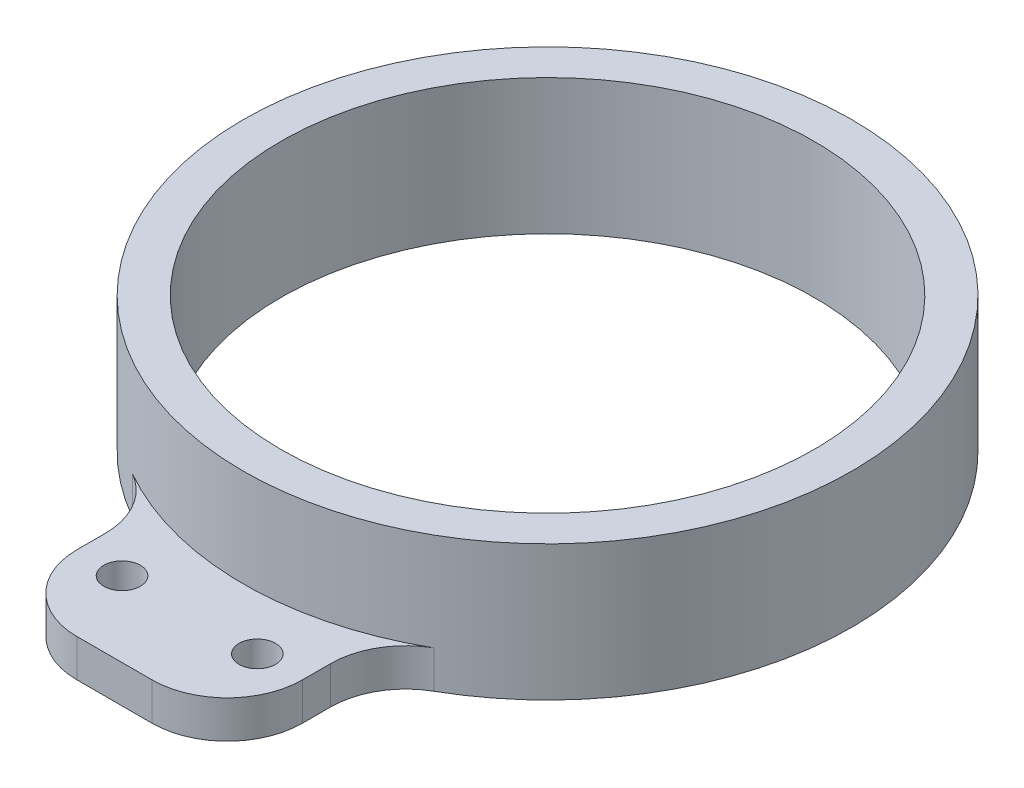
ISO-10303-21;
HEADER;
FILE_DESCRIPTION(('STEP AP214'),'2;1');
FILE_NAME('part.step','',(''),(''),'','','');
FILE_SCHEMA(('AUTOMOTIVE_DESIGN { 1 0 10303 214 1 1 1 1 }'));
ENDSEC;
DATA;
#1=APPLICATION_CONTEXT('core data for automotive mechanical design processes');
#2=APPLICATION_PROTOCOL_DEFINITION('international standard','automotive_design',2000,#1);
#3=PRODUCT_CONTEXT('',#1,'mechanical');
#4=PRODUCT('Part','Part','',(#3));
#5=PRODUCT_RELATED_PRODUCT_CATEGORY('part','',(#4));
#6=PRODUCT_DEFINITION_FORMATION('','',#4);
#7=PRODUCT_DEFINITION_CONTEXT('part definition',#1,'design');
#8=PRODUCT_DEFINITION('design','',#6,#7);
#9=PRODUCT_DEFINITION_SHAPE('','',#8);
#10=(LENGTH_UNIT() NAMED_UNIT(*) SI_UNIT(.MILLI.,.METRE.));
#11=(NAMED_UNIT(*) PLANE_ANGLE_UNIT() SI_UNIT($,.RADIAN.));
#12=(NAMED_UNIT(*) SI_UNIT($,.STERADIAN.) SOLID_ANGLE_UNIT());
#13=UNCERTAINTY_MEASURE_WITH_UNIT(LENGTH_MEASURE(1.E-05),#10,'distance_accuracy_value','');
#14=(GEOMETRIC_REPRESENTATION_CONTEXT(3) GLOBAL_UNCERTAINTY_ASSIGNED_CONTEXT((#13)) GLOBAL_UNIT_ASSIGNED_CONTEXT((#10,
#11,#12)) REPRESENTATION_CONTEXT('',''));
#15=CARTESIAN_POINT('',(0.,0.,0.));
#16=DIRECTION('',(0.,0.,1.));
#17=DIRECTION('',(1.,0.,0.));
#18=AXIS2_PLACEMENT_3D('',#15,#16,#17);
#19=CARTESIAN_POINT('',(0.,9.,0.));
#20=DIRECTION('',(0.,1.,0.));
#21=DIRECTION('',(0.,0.,1.));
#22=AXIS2_PLACEMENT_3D('',#19,#20,#21);
#23=PLANE('',#22);
#24=CARTESIAN_POINT('',(0.,9.,0.));
#25=DIRECTION('',(0.,1.,0.));
#26=DIRECTION('',(0.,0.,1.));
#27=AXIS2_PLACEMENT_3D('',#24,#25,#26);
#28=CIRCLE('',#27,40.5);
#29=CARTESIAN_POINT('',(0.,9.,40.5));
#30=VERTEX_POINT('',#29);
#31=EDGE_CURVE('E127',#30,#30,#28,.T.);
#32=ORIENTED_EDGE('',*,*,#31,.T.);
#33=EDGE_LOOP('',(#32));
#34=FACE_BOUND('',#33,.T.);
#35=CARTESIAN_POINT('',(0.,9.,0.));
#36=DIRECTION('',(0.,1.,0.));
#37=DIRECTION('',(0.,0.,1.));
#38=AXIS2_PLACEMENT_3D('',#35,#36,#37);
#39=CIRCLE('',#38,35.5);
#40=CARTESIAN_POINT('',(0.,9.,35.5));
#41=VERTEX_POINT('',#40);
#42=EDGE_CURVE('E128',#41,#41,#39,.T.);
#43=ORIENTED_EDGE('',*,*,#42,.F.);
#44=EDGE_LOOP('',(#43));
#45=FACE_BOUND('',#44,.T.);
#46=ADVANCED_FACE('F33',(#34,#45),#23,.T.);
#47=CARTESIAN_POINT('',(0.,-9.,0.));
#48=DIRECTION('',(0.,1.,0.));
#49=DIRECTION('',(0.,0.,1.));
#50=AXIS2_PLACEMENT_3D('',#47,#48,#49);
#51=PLANE('',#50);
#52=DIRECTION('',(-1.,0.,0.));
#53=VECTOR('',#52,1.);
#54=CARTESIAN_POINT('',(-15.,-9.,57.6198086119534));
#55=LINE('',#54,#53);
#56=CARTESIAN_POINT('',(5.,-9.,57.6198086119534));
#57=VERTEX_POINT('',#56);
#58=CARTESIAN_POINT('',(-5.,-9.,57.6198086119534));
#59=VERTEX_POINT('',#58);
#60=EDGE_CURVE('E176',#57,#59,#55,.T.);
#61=ORIENTED_EDGE('',*,*,#60,.T.);
#62=CARTESIAN_POINT('',(-5.,-9.,47.6198086119534));
#63=DIRECTION('',(0.,1.,0.));
#64=DIRECTION('',(0.,0.,1.));
#65=AXIS2_PLACEMENT_3D('',#62,#63,#64);
#66=CIRCLE('',#65,10.);
#67=CARTESIAN_POINT('',(-15.,-9.,47.6198086119534));
#68=VERTEX_POINT('',#67);
#69=EDGE_CURVE('E152',#59,#68,#66,.F.);
#70=ORIENTED_EDGE('',*,*,#69,.T.);
#71=DIRECTION('',(0.,0.,-1.));
#72=VECTOR('',#71,1.);
#73=CARTESIAN_POINT('',(-15.,-9.,37.6198086119534));
#74=LINE('',#73,#72);
#75=CARTESIAN_POINT('',(-15.,-9.,43.8776708588776));
#76=VERTEX_POINT('',#75);
#77=EDGE_CURVE('E168',#68,#76,#74,.T.);
#78=ORIENTED_EDGE('',*,*,#77,.T.);
#79=CARTESIAN_POINT('',(-25.,-9.,43.8776708588776));
#80=DIRECTION('',(0.,1.,0.));
#81=DIRECTION('',(0.,0.,1.));
#82=AXIS2_PLACEMENT_3D('',#79,#80,#81);
#83=CIRCLE('',#82,10.);
#84=CARTESIAN_POINT('',(-20.049504950495,-9.,35.1890231640504));
#85=VERTEX_POINT('',#84);
#86=EDGE_CURVE('E41',#76,#85,#83,.T.);
#87=ORIENTED_EDGE('',*,*,#86,.T.);
#88=CARTESIAN_POINT('',(0.,-9.,0.));
#89=DIRECTION('',(0.,1.,0.));
#90=DIRECTION('',(0.,0.,1.));
#91=AXIS2_PLACEMENT_3D('',#88,#89,#90);
#92=CIRCLE('',#91,40.5);
#93=CARTESIAN_POINT('',(20.049504950495,-9.,35.1890231640504));
#94=VERTEX_POINT('',#93);
#95=EDGE_CURVE('E116',#94,#85,#92,.T.);
#96=ORIENTED_EDGE('',*,*,#95,.F.);
#97=CARTESIAN_POINT('',(25.,-9.,43.8776708588776));
#98=DIRECTION('',(0.,1.,0.));
#99=DIRECTION('',(0.,0.,1.));
#100=AXIS2_PLACEMENT_3D('',#97,#98,#99);
#101=CIRCLE('',#100,10.);
#102=CARTESIAN_POINT('',(15.,-9.,43.8776708588776));
#103=VERTEX_POINT('',#102);
#104=EDGE_CURVE('E99',#94,#103,#101,.T.);
#105=ORIENTED_EDGE('',*,*,#104,.T.);
#106=DIRECTION('',(0.,0.,1.));
#107=VECTOR('',#106,1.);
#108=CARTESIAN_POINT('',(15.,-9.,57.6198086119534));
#109=LINE('',#108,#107);
#110=CARTESIAN_POINT('',(15.,-9.,47.6198086119534));
#111=VERTEX_POINT('',#110);
#112=EDGE_CURVE('E174',#103,#111,#109,.T.);
#113=ORIENTED_EDGE('',*,*,#112,.T.);
#114=CARTESIAN_POINT('',(5.,-9.,47.6198086119534));
#115=DIRECTION('',(0.,1.,0.));
#116=DIRECTION('',(0.,0.,1.));
#117=AXIS2_PLACEMENT_3D('',#114,#115,#116);
#118=CIRCLE('',#117,10.);
#119=EDGE_CURVE('E150',#111,#57,#118,.F.);
#120=ORIENTED_EDGE('',*,*,#119,.T.);
#121=EDGE_LOOP('',(#61,#70,#78,#87,#96,#105,#113,#120));
#122=FACE_BOUND('',#121,.T.);
#123=CARTESIAN_POINT('',(0.,-9.,0.));
#124=DIRECTION('',(0.,1.,0.));
#125=DIRECTION('',(0.,0.,1.));
#126=AXIS2_PLACEMENT_3D('',#123,#124,#125);
#127=CIRCLE('',#126,35.5);
#128=CARTESIAN_POINT('',(0.,-9.,35.5));
#129=VERTEX_POINT('',#128);
#130=EDGE_CURVE('E133',#129,#129,#127,.T.);
#131=ORIENTED_EDGE('',*,*,#130,.T.);
#132=EDGE_LOOP('',(#131));
#133=FACE_BOUND('',#132,.T.);
#134=CARTESIAN_POINT('',(9.,-9.,47.6198086119534));
#135=DIRECTION('',(0.,-1.,0.));
#136=DIRECTION('',(0.,0.,1.));
#137=AXIS2_PLACEMENT_3D('',#134,#135,#136);
#138=CIRCLE('',#137,2.42927418863049);
#139=CARTESIAN_POINT('',(9.,-9.,50.0490828005839));
#140=VERTEX_POINT('',#139);
#141=EDGE_CURVE('E246',#140,#140,#138,.T.);
#142=ORIENTED_EDGE('',*,*,#141,.F.);
#143=EDGE_LOOP('',(#142));
#144=FACE_BOUND('',#143,.T.);
#145=CARTESIAN_POINT('',(-9.,-9.,47.6198086119534));
#146=DIRECTION('',(0.,-1.,0.));
#147=DIRECTION('',(0.,0.,-1.));
#148=AXIS2_PLACEMENT_3D('',#145,#146,#147);
#149=CIRCLE('',#148,2.42927418863049);
#150=CARTESIAN_POINT('',(-9.,-9.,45.1905344233229));
#151=VERTEX_POINT('',#150);
#152=EDGE_CURVE('E248',#151,#151,#149,.T.);
#153=ORIENTED_EDGE('',*,*,#152,.F.);
#154=EDGE_LOOP('',(#153));
#155=FACE_BOUND('',#154,.T.);
#156=ADVANCED_FACE('F124',(#122,#133,#144,#155),#51,.F.);
#157=CARTESIAN_POINT('',(0.,9.,0.));
#158=DIRECTION('',(0.,-1.,0.));
#159=DIRECTION('',(0.,0.,-1.));
#160=AXIS2_PLACEMENT_3D('',#157,#158,#159);
#161=CYLINDRICAL_SURFACE('',#160,40.5);
#162=CARTESIAN_POINT('',(0.,-4.,0.));
#163=DIRECTION('',(0.,1.,0.));
#164=DIRECTION('',(0.,0.,-1.));
#165=AXIS2_PLACEMENT_3D('',#162,#163,#164);
#166=CIRCLE('',#165,40.5);
#167=CARTESIAN_POINT('',(-20.049504950495,-4.,35.1890231640504));
#168=VERTEX_POINT('',#167);
#169=CARTESIAN_POINT('',(20.049504950495,-4.,35.1890231640504));
#170=VERTEX_POINT('',#169);
#171=EDGE_CURVE('E118',#168,#170,#166,.T.);
#172=ORIENTED_EDGE('',*,*,#171,.T.);
#173=DIRECTION('',(0.,-1.,0.));
#174=VECTOR('',#173,1.);
#175=CARTESIAN_POINT('',(20.0495049504951,9.,35.1890231640504));
#176=LINE('',#175,#174);
#177=EDGE_CURVE('E103',#170,#94,#176,.T.);
#178=ORIENTED_EDGE('',*,*,#177,.T.);
#179=ORIENTED_EDGE('',*,*,#95,.T.);
#180=DIRECTION('',(0.,-1.,0.));
#181=VECTOR('',#180,1.);
#182=CARTESIAN_POINT('',(-20.0495049504951,9.,35.1890231640504));
#183=LINE('',#182,#181);
#184=EDGE_CURVE('E121',#85,#168,#183,.F.);
#185=ORIENTED_EDGE('',*,*,#184,.T.);
#186=EDGE_LOOP('',(#172,#178,#179,#185));
#187=FACE_BOUND('',#186,.T.);
#188=ORIENTED_EDGE('',*,*,#31,.F.);
#189=EDGE_LOOP('',(#188));
#190=FACE_BOUND('',#189,.T.);
#191=ADVANCED_FACE('F113',(#187,#190),#161,.T.);
#192=CARTESIAN_POINT('',(0.,9.,0.));
#193=DIRECTION('',(0.,-1.,0.));
#194=DIRECTION('',(0.,0.,-1.));
#195=AXIS2_PLACEMENT_3D('',#192,#193,#194);
#196=CYLINDRICAL_SURFACE('',#195,35.5);
#197=ORIENTED_EDGE('',*,*,#42,.T.);
#198=EDGE_LOOP('',(#197));
#199=FACE_BOUND('',#198,.T.);
#200=ORIENTED_EDGE('',*,*,#130,.F.);
#201=EDGE_LOOP('',(#200));
#202=FACE_BOUND('',#201,.T.);
#203=ADVANCED_FACE('F183',(#199,#202),#196,.F.);
#204=CARTESIAN_POINT('',(-15.,-4.,37.6198086119534));
#205=DIRECTION('',(-1.,0.,0.));
#206=DIRECTION('',(0.,0.,1.));
#207=AXIS2_PLACEMENT_3D('',#204,#205,#206);
#208=PLANE('',#207);
#209=DIRECTION('',(0.,0.,-1.));
#210=VECTOR('',#209,1.);
#211=CARTESIAN_POINT('',(-15.,-4.,37.6198086119534));
#212=LINE('',#211,#210);
#213=CARTESIAN_POINT('',(-15.,-4.,47.6198086119534));
#214=VERTEX_POINT('',#213);
#215=CARTESIAN_POINT('',(-15.,-4.,43.8776708588776));
#216=VERTEX_POINT('',#215);
#217=EDGE_CURVE('E166',#214,#216,#212,.T.);
#218=ORIENTED_EDGE('',*,*,#217,.T.);
#219=DIRECTION('',(0.,-1.,0.));
#220=VECTOR('',#219,1.);
#221=CARTESIAN_POINT('',(-15.,-4.,43.8776708588776));
#222=LINE('',#221,#220);
#223=EDGE_CURVE('E143',#216,#76,#222,.T.);
#224=ORIENTED_EDGE('',*,*,#223,.T.);
#225=ORIENTED_EDGE('',*,*,#77,.F.);
#226=DIRECTION('',(0.,-1.,0.));
#227=VECTOR('',#226,1.);
#228=CARTESIAN_POINT('',(-15.,-4.,47.6198086119534));
#229=LINE('',#228,#227);
#230=EDGE_CURVE('E141',#68,#214,#229,.F.);
#231=ORIENTED_EDGE('',*,*,#230,.T.);
#232=EDGE_LOOP('',(#218,#224,#225,#231));
#233=FACE_BOUND('',#232,.T.);
#234=ADVANCED_FACE('F185',(#233),#208,.T.);
#235=CARTESIAN_POINT('',(-15.,-4.,57.6198086119534));
#236=DIRECTION('',(0.,0.,1.));
#237=DIRECTION('',(1.,0.,0.));
#238=AXIS2_PLACEMENT_3D('',#235,#236,#237);
#239=PLANE('',#238);
#240=DIRECTION('',(-1.,0.,0.));
#241=VECTOR('',#240,1.);
#242=CARTESIAN_POINT('',(-15.,-4.,57.6198086119534));
#243=LINE('',#242,#241);
#244=CARTESIAN_POINT('',(5.,-4.,57.6198086119534));
#245=VERTEX_POINT('',#244);
#246=CARTESIAN_POINT('',(-5.,-4.,57.6198086119534));
#247=VERTEX_POINT('',#246);
#248=EDGE_CURVE('E164',#245,#247,#243,.T.);
#249=ORIENTED_EDGE('',*,*,#248,.T.);
#250=DIRECTION('',(0.,-1.,0.));
#251=VECTOR('',#250,1.);
#252=CARTESIAN_POINT('',(-5.,-4.,57.6198086119534));
#253=LINE('',#252,#251);
#254=EDGE_CURVE('E147',#247,#59,#253,.T.);
#255=ORIENTED_EDGE('',*,*,#254,.T.);
#256=ORIENTED_EDGE('',*,*,#60,.F.);
#257=DIRECTION('',(0.,-1.,0.));
#258=VECTOR('',#257,1.);
#259=CARTESIAN_POINT('',(5.,-4.,57.6198086119534));
#260=LINE('',#259,#258);
#261=EDGE_CURVE('E55',#57,#245,#260,.F.);
#262=ORIENTED_EDGE('',*,*,#261,.T.);
#263=EDGE_LOOP('',(#249,#255,#256,#262));
#264=FACE_BOUND('',#263,.T.);
#265=ADVANCED_FACE('F192',(#264),#239,.T.);
#266=CARTESIAN_POINT('',(15.,-4.,57.6198086119534));
#267=DIRECTION('',(1.,0.,0.));
#268=DIRECTION('',(0.,0.,-1.));
#269=AXIS2_PLACEMENT_3D('',#266,#267,#268);
#270=PLANE('',#269);
#271=ORIENTED_EDGE('',*,*,#112,.F.);
#272=DIRECTION('',(0.,-1.,0.));
#273=VECTOR('',#272,1.);
#274=CARTESIAN_POINT('',(15.,-4.,43.8776708588776));
#275=LINE('',#274,#273);
#276=CARTESIAN_POINT('',(15.,-4.,43.8776708588776));
#277=VERTEX_POINT('',#276);
#278=EDGE_CURVE('E104',#103,#277,#275,.F.);
#279=ORIENTED_EDGE('',*,*,#278,.T.);
#280=DIRECTION('',(0.,0.,1.));
#281=VECTOR('',#280,1.);
#282=CARTESIAN_POINT('',(15.,-4.,57.6198086119534));
#283=LINE('',#282,#281);
#284=CARTESIAN_POINT('',(15.,-4.,47.6198086119534));
#285=VERTEX_POINT('',#284);
#286=EDGE_CURVE('E160',#277,#285,#283,.T.);
#287=ORIENTED_EDGE('',*,*,#286,.T.);
#288=DIRECTION('',(0.,-1.,0.));
#289=VECTOR('',#288,1.);
#290=CARTESIAN_POINT('',(15.,-4.,47.6198086119534));
#291=LINE('',#290,#289);
#292=EDGE_CURVE('E120',#285,#111,#291,.T.);
#293=ORIENTED_EDGE('',*,*,#292,.T.);
#294=EDGE_LOOP('',(#271,#279,#287,#293));
#295=FACE_BOUND('',#294,.T.);
#296=ADVANCED_FACE('F222',(#295),#270,.T.);
#297=CARTESIAN_POINT('',(0.,-4.,0.));
#298=DIRECTION('',(0.,-1.,0.));
#299=DIRECTION('',(0.,0.,-1.));
#300=AXIS2_PLACEMENT_3D('',#297,#298,#299);
#301=PLANE('',#300);
#302=CARTESIAN_POINT('',(9.,-4.,47.6198086119534));
#303=DIRECTION('',(0.,-1.,0.));
#304=DIRECTION('',(0.,0.,1.));
#305=AXIS2_PLACEMENT_3D('',#302,#303,#304);
#306=CIRCLE('',#305,2.42927418863049);
#307=CARTESIAN_POINT('',(9.,-4.,50.0490828005839));
#308=VERTEX_POINT('',#307);
#309=EDGE_CURVE('E243',#308,#308,#306,.T.);
#310=ORIENTED_EDGE('',*,*,#309,.T.);
#311=EDGE_LOOP('',(#310));
#312=FACE_BOUND('',#311,.T.);
#313=CARTESIAN_POINT('',(-9.,-4.,47.6198086119534));
#314=DIRECTION('',(0.,-1.,0.));
#315=DIRECTION('',(0.,0.,-1.));
#316=AXIS2_PLACEMENT_3D('',#313,#314,#315);
#317=CIRCLE('',#316,2.42927418863049);
#318=CARTESIAN_POINT('',(-9.,-4.,45.1905344233229));
#319=VERTEX_POINT('',#318);
#320=EDGE_CURVE('E177',#319,#319,#317,.T.);
#321=ORIENTED_EDGE('',*,*,#320,.T.);
#322=EDGE_LOOP('',(#321));
#323=FACE_BOUND('',#322,.T.);
#324=ORIENTED_EDGE('',*,*,#217,.F.);
#325=CARTESIAN_POINT('',(-5.,-4.,47.6198086119534));
#326=DIRECTION('',(0.,-1.,0.));
#327=DIRECTION('',(0.,0.,-1.));
#328=AXIS2_PLACEMENT_3D('',#325,#326,#327);
#329=CIRCLE('',#328,10.);
#330=EDGE_CURVE('E48',#214,#247,#329,.F.);
#331=ORIENTED_EDGE('',*,*,#330,.T.);
#332=ORIENTED_EDGE('',*,*,#248,.F.);
#333=CARTESIAN_POINT('',(5.,-4.,47.6198086119534));
#334=DIRECTION('',(0.,-1.,0.));
#335=DIRECTION('',(0.,0.,-1.));
#336=AXIS2_PLACEMENT_3D('',#333,#334,#335);
#337=CIRCLE('',#336,10.);
#338=EDGE_CURVE('E154',#245,#285,#337,.F.);
#339=ORIENTED_EDGE('',*,*,#338,.T.);
#340=ORIENTED_EDGE('',*,*,#286,.F.);
#341=CARTESIAN_POINT('',(25.,-4.,43.8776708588776));
#342=DIRECTION('',(0.,-1.,0.));
#343=DIRECTION('',(0.,0.,-1.));
#344=AXIS2_PLACEMENT_3D('',#341,#342,#343);
#345=CIRCLE('',#344,10.);
#346=EDGE_CURVE('E109',#277,#170,#345,.T.);
#347=ORIENTED_EDGE('',*,*,#346,.T.);
#348=ORIENTED_EDGE('',*,*,#171,.F.);
#349=CARTESIAN_POINT('',(-25.,-4.,43.8776708588776));
#350=DIRECTION('',(0.,-1.,0.));
#351=DIRECTION('',(0.,0.,-1.));
#352=AXIS2_PLACEMENT_3D('',#349,#350,#351);
#353=CIRCLE('',#352,10.);
#354=EDGE_CURVE('E11',#168,#216,#353,.T.);
#355=ORIENTED_EDGE('',*,*,#354,.T.);
#356=EDGE_LOOP('',(#324,#331,#332,#339,#340,#347,#348,#355));
#357=FACE_BOUND('',#356,.T.);
#358=ADVANCED_FACE('F158',(#312,#323,#357),#301,.F.);
#359=CARTESIAN_POINT('',(-9.,-4.,47.6198086119534));
#360=DIRECTION('',(0.,-1.,0.));
#361=DIRECTION('',(0.,0.,-1.));
#362=AXIS2_PLACEMENT_3D('',#359,#360,#361);
#363=CYLINDRICAL_SURFACE('',#362,2.42927418863049);
#364=ORIENTED_EDGE('',*,*,#320,.F.);
#365=EDGE_LOOP('',(#364));
#366=FACE_BOUND('',#365,.T.);
#367=ORIENTED_EDGE('',*,*,#152,.T.);
#368=EDGE_LOOP('',(#367));
#369=FACE_BOUND('',#368,.T.);
#370=ADVANCED_FACE('F228',(#366,#369),#363,.F.);
#371=CARTESIAN_POINT('',(9.,-4.,47.6198086119534));
#372=DIRECTION('',(0.,-1.,0.));
#373=DIRECTION('',(0.,0.,-1.));
#374=AXIS2_PLACEMENT_3D('',#371,#372,#373);
#375=CYLINDRICAL_SURFACE('',#374,2.42927418863049);
#376=ORIENTED_EDGE('',*,*,#309,.F.);
#377=EDGE_LOOP('',(#376));
#378=FACE_BOUND('',#377,.T.);
#379=ORIENTED_EDGE('',*,*,#141,.T.);
#380=EDGE_LOOP('',(#379));
#381=FACE_BOUND('',#380,.T.);
#382=ADVANCED_FACE('F209',(#378,#381),#375,.F.);
#383=CARTESIAN_POINT('',(25.,9.,43.8776708588776));
#384=DIRECTION('',(0.,-1.,0.));
#385=DIRECTION('',(0.,0.,-1.));
#386=AXIS2_PLACEMENT_3D('',#383,#384,#385);
#387=CYLINDRICAL_SURFACE('',#386,10.);
#388=ORIENTED_EDGE('',*,*,#346,.F.);
#389=ORIENTED_EDGE('',*,*,#278,.F.);
#390=ORIENTED_EDGE('',*,*,#104,.F.);
#391=ORIENTED_EDGE('',*,*,#177,.F.);
#392=EDGE_LOOP('',(#388,#389,#390,#391));
#393=FACE_BOUND('',#392,.T.);
#394=ADVANCED_FACE('F102',(#393),#387,.F.);
#395=CARTESIAN_POINT('',(-25.,9.,43.8776708588776));
#396=DIRECTION('',(0.,-1.,0.));
#397=DIRECTION('',(0.,0.,-1.));
#398=AXIS2_PLACEMENT_3D('',#395,#396,#397);
#399=CYLINDRICAL_SURFACE('',#398,10.);
#400=ORIENTED_EDGE('',*,*,#354,.F.);
#401=ORIENTED_EDGE('',*,*,#184,.F.);
#402=ORIENTED_EDGE('',*,*,#86,.F.);
#403=ORIENTED_EDGE('',*,*,#223,.F.);
#404=EDGE_LOOP('',(#400,#401,#402,#403));
#405=FACE_BOUND('',#404,.T.);
#406=ADVANCED_FACE('F208',(#405),#399,.F.);
#407=CARTESIAN_POINT('',(-5.,-4.,47.6198086119534));
#408=DIRECTION('',(0.,-1.,0.));
#409=DIRECTION('',(0.,0.,-1.));
#410=AXIS2_PLACEMENT_3D('',#407,#408,#409);
#411=CYLINDRICAL_SURFACE('',#410,10.);
#412=ORIENTED_EDGE('',*,*,#330,.F.);
#413=ORIENTED_EDGE('',*,*,#230,.F.);
#414=ORIENTED_EDGE('',*,*,#69,.F.);
#415=ORIENTED_EDGE('',*,*,#254,.F.);
#416=EDGE_LOOP('',(#412,#413,#414,#415));
#417=FACE_BOUND('',#416,.T.);
#418=ADVANCED_FACE('F211',(#417),#411,.T.);
#419=CARTESIAN_POINT('',(5.,-4.,47.6198086119534));
#420=DIRECTION('',(0.,-1.,0.));
#421=DIRECTION('',(0.,0.,-1.));
#422=AXIS2_PLACEMENT_3D('',#419,#420,#421);
#423=CYLINDRICAL_SURFACE('',#422,10.);
#424=ORIENTED_EDGE('',*,*,#338,.F.);
#425=ORIENTED_EDGE('',*,*,#261,.F.);
#426=ORIENTED_EDGE('',*,*,#119,.F.);
#427=ORIENTED_EDGE('',*,*,#292,.F.);
#428=EDGE_LOOP('',(#424,#425,#426,#427));
#429=FACE_BOUND('',#428,.T.);
#430=ADVANCED_FACE('F35',(#429),#423,.T.);
#431=CLOSED_SHELL('',(#46,#156,#191,#203,#234,#265,#296,#358,#370,#382,#394,#406,#418,#430));
#432=MANIFOLD_SOLID_BREP('B2',#431);
#433=ADVANCED_BREP_SHAPE_REPRESENTATION('',(#18,#432),#14);
#434=SHAPE_DEFINITION_REPRESENTATION(#9,#433);
ENDSEC;
END-ISO-10303-21;
